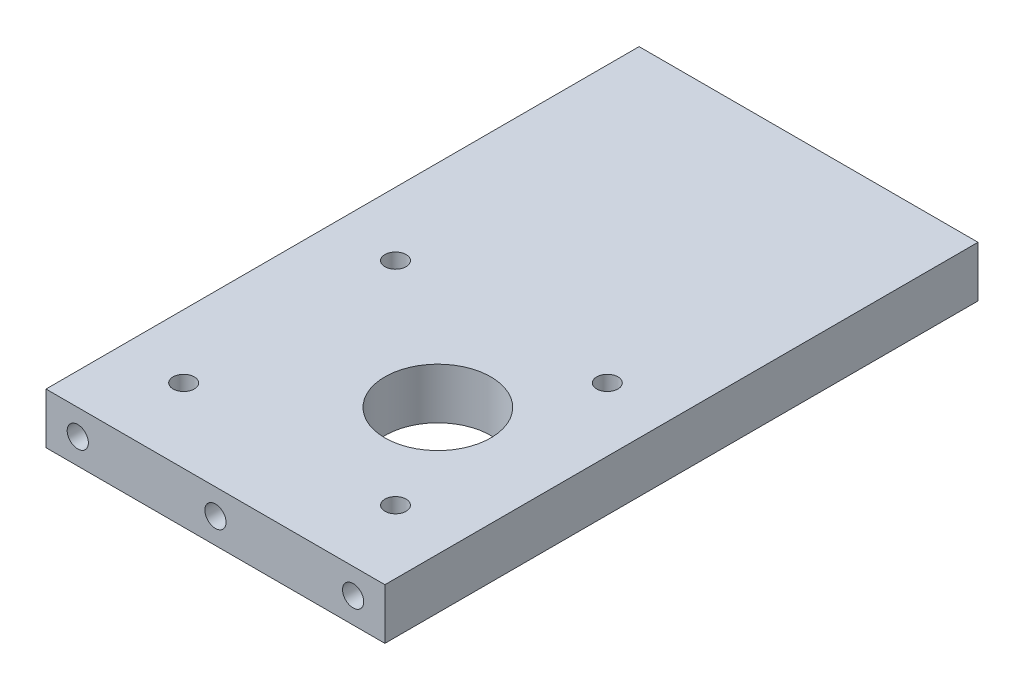
ISO-10303-21;
HEADER;
FILE_DESCRIPTION(('STEP AP214'),'2;1');
FILE_NAME('part.step','',(''),(''),'','','');
FILE_SCHEMA(('AUTOMOTIVE_DESIGN { 1 0 10303 214 1 1 1 1 }'));
ENDSEC;
DATA;
#1=APPLICATION_CONTEXT('core data for automotive mechanical design processes');
#2=APPLICATION_PROTOCOL_DEFINITION('international standard','automotive_design',2000,#1);
#3=PRODUCT_CONTEXT('',#1,'mechanical');
#4=PRODUCT('Part','Part','',(#3));
#5=PRODUCT_RELATED_PRODUCT_CATEGORY('part','',(#4));
#6=PRODUCT_DEFINITION_FORMATION('','',#4);
#7=PRODUCT_DEFINITION_CONTEXT('part definition',#1,'design');
#8=PRODUCT_DEFINITION('design','',#6,#7);
#9=PRODUCT_DEFINITION_SHAPE('','',#8);
#10=(LENGTH_UNIT() NAMED_UNIT(*) SI_UNIT(.MILLI.,.METRE.));
#11=(NAMED_UNIT(*) PLANE_ANGLE_UNIT() SI_UNIT($,.RADIAN.));
#12=(NAMED_UNIT(*) SI_UNIT($,.STERADIAN.) SOLID_ANGLE_UNIT());
#13=UNCERTAINTY_MEASURE_WITH_UNIT(LENGTH_MEASURE(1.E-05),#10,'distance_accuracy_value','');
#14=(GEOMETRIC_REPRESENTATION_CONTEXT(3) GLOBAL_UNCERTAINTY_ASSIGNED_CONTEXT((#13)) GLOBAL_UNIT_ASSIGNED_CONTEXT((#10,
#11,#12)) REPRESENTATION_CONTEXT('',''));
#15=CARTESIAN_POINT('',(0.,0.,0.));
#16=DIRECTION('',(0.,0.,1.));
#17=DIRECTION('',(1.,0.,0.));
#18=AXIS2_PLACEMENT_3D('',#15,#16,#17);
#19=CARTESIAN_POINT('',(0.,6.,0.));
#20=DIRECTION('',(0.,1.,0.));
#21=DIRECTION('',(0.,0.,1.));
#22=AXIS2_PLACEMENT_3D('',#19,#20,#21);
#23=PLANE('',#22);
#24=CARTESIAN_POINT('',(-25.,6.,-67.5));
#25=DIRECTION('',(0.,1.,0.));
#26=DIRECTION('',(0.,0.,1.));
#27=AXIS2_PLACEMENT_3D('',#24,#25,#26);
#28=CIRCLE('',#27,2.5);
#29=CARTESIAN_POINT('',(-25.,6.,-65.));
#30=VERTEX_POINT('',#29);
#31=EDGE_CURVE('E173',#30,#30,#28,.T.);
#32=ORIENTED_EDGE('',*,*,#31,.F.);
#33=EDGE_LOOP('',(#32));
#34=FACE_BOUND('',#33,.T.);
#35=CARTESIAN_POINT('',(25.,6.,-67.5));
#36=DIRECTION('',(0.,1.,0.));
#37=DIRECTION('',(0.,0.,1.));
#38=AXIS2_PLACEMENT_3D('',#35,#36,#37);
#39=CIRCLE('',#38,2.5);
#40=CARTESIAN_POINT('',(25.,6.,-65.));
#41=VERTEX_POINT('',#40);
#42=EDGE_CURVE('E179',#41,#41,#39,.T.);
#43=ORIENTED_EDGE('',*,*,#42,.F.);
#44=EDGE_LOOP('',(#43));
#45=FACE_BOUND('',#44,.T.);
#46=CARTESIAN_POINT('',(25.,6.,-17.5));
#47=DIRECTION('',(0.,1.,0.));
#48=DIRECTION('',(0.,0.,1.));
#49=AXIS2_PLACEMENT_3D('',#46,#47,#48);
#50=CIRCLE('',#49,2.5);
#51=CARTESIAN_POINT('',(25.,6.,-15.));
#52=VERTEX_POINT('',#51);
#53=EDGE_CURVE('E185',#52,#52,#50,.T.);
#54=ORIENTED_EDGE('',*,*,#53,.F.);
#55=EDGE_LOOP('',(#54));
#56=FACE_BOUND('',#55,.T.);
#57=CARTESIAN_POINT('',(-25.,6.,-17.5));
#58=DIRECTION('',(0.,1.,0.));
#59=DIRECTION('',(0.,0.,1.));
#60=AXIS2_PLACEMENT_3D('',#57,#58,#59);
#61=CIRCLE('',#60,2.5);
#62=CARTESIAN_POINT('',(-25.,6.,-15.));
#63=VERTEX_POINT('',#62);
#64=EDGE_CURVE('E191',#63,#63,#61,.T.);
#65=ORIENTED_EDGE('',*,*,#64,.F.);
#66=EDGE_LOOP('',(#65));
#67=FACE_BOUND('',#66,.T.);
#68=DIRECTION('',(0.,0.,1.));
#69=VECTOR('',#68,1.);
#70=CARTESIAN_POINT('',(-40.,6.,-140.));
#71=LINE('',#70,#69);
#72=CARTESIAN_POINT('',(-40.,6.,-140.));
#73=VERTEX_POINT('',#72);
#74=CARTESIAN_POINT('',(-40.,6.,0.));
#75=VERTEX_POINT('',#74);
#76=EDGE_CURVE('E204',#73,#75,#71,.T.);
#77=ORIENTED_EDGE('',*,*,#76,.T.);
#78=DIRECTION('',(1.,0.,0.));
#79=VECTOR('',#78,1.);
#80=CARTESIAN_POINT('',(-40.,6.,0.));
#81=LINE('',#80,#79);
#82=CARTESIAN_POINT('',(40.,6.,0.));
#83=VERTEX_POINT('',#82);
#84=EDGE_CURVE('E91',#75,#83,#81,.T.);
#85=ORIENTED_EDGE('',*,*,#84,.T.);
#86=DIRECTION('',(0.,0.,-1.));
#87=VECTOR('',#86,1.);
#88=CARTESIAN_POINT('',(40.,6.,-140.));
#89=LINE('',#88,#87);
#90=CARTESIAN_POINT('',(40.,6.,-140.));
#91=VERTEX_POINT('',#90);
#92=EDGE_CURVE('E207',#83,#91,#89,.T.);
#93=ORIENTED_EDGE('',*,*,#92,.T.);
#94=DIRECTION('',(-1.,0.,0.));
#95=VECTOR('',#94,1.);
#96=CARTESIAN_POINT('',(-40.,6.,-140.));
#97=LINE('',#96,#95);
#98=EDGE_CURVE('E60',#91,#73,#97,.T.);
#99=ORIENTED_EDGE('',*,*,#98,.T.);
#100=EDGE_LOOP('',(#77,#85,#93,#99));
#101=FACE_BOUND('',#100,.T.);
#102=CARTESIAN_POINT('',(10.,6.,-42.5));
#103=DIRECTION('',(0.,1.,0.));
#104=DIRECTION('',(0.,0.,1.));
#105=AXIS2_PLACEMENT_3D('',#102,#103,#104);
#106=CIRCLE('',#105,12.5);
#107=CARTESIAN_POINT('',(10.,6.,-30.));
#108=VERTEX_POINT('',#107);
#109=EDGE_CURVE('E198',#108,#108,#106,.T.);
#110=ORIENTED_EDGE('',*,*,#109,.F.);
#111=EDGE_LOOP('',(#110));
#112=FACE_BOUND('',#111,.T.);
#113=ADVANCED_FACE('F43',(#34,#45,#56,#67,#101,#112),#23,.T.);
#114=CARTESIAN_POINT('',(0.,-6.,0.));
#115=DIRECTION('',(0.,1.,0.));
#116=DIRECTION('',(0.,0.,1.));
#117=AXIS2_PLACEMENT_3D('',#114,#115,#116);
#118=PLANE('',#117);
#119=CARTESIAN_POINT('',(-25.,-6.,-67.5));
#120=DIRECTION('',(0.,1.,0.));
#121=DIRECTION('',(0.,0.,1.));
#122=AXIS2_PLACEMENT_3D('',#119,#120,#121);
#123=CIRCLE('',#122,2.5);
#124=CARTESIAN_POINT('',(-25.,-6.,-65.));
#125=VERTEX_POINT('',#124);
#126=EDGE_CURVE('E176',#125,#125,#123,.T.);
#127=ORIENTED_EDGE('',*,*,#126,.T.);
#128=EDGE_LOOP('',(#127));
#129=FACE_BOUND('',#128,.T.);
#130=CARTESIAN_POINT('',(25.,-6.,-67.5));
#131=DIRECTION('',(0.,1.,0.));
#132=DIRECTION('',(0.,0.,1.));
#133=AXIS2_PLACEMENT_3D('',#130,#131,#132);
#134=CIRCLE('',#133,2.5);
#135=CARTESIAN_POINT('',(25.,-6.,-65.));
#136=VERTEX_POINT('',#135);
#137=EDGE_CURVE('E182',#136,#136,#134,.T.);
#138=ORIENTED_EDGE('',*,*,#137,.T.);
#139=EDGE_LOOP('',(#138));
#140=FACE_BOUND('',#139,.T.);
#141=CARTESIAN_POINT('',(25.,-6.,-17.5));
#142=DIRECTION('',(0.,1.,0.));
#143=DIRECTION('',(0.,0.,1.));
#144=AXIS2_PLACEMENT_3D('',#141,#142,#143);
#145=CIRCLE('',#144,2.5);
#146=CARTESIAN_POINT('',(25.,-6.,-15.));
#147=VERTEX_POINT('',#146);
#148=EDGE_CURVE('E188',#147,#147,#145,.T.);
#149=ORIENTED_EDGE('',*,*,#148,.T.);
#150=EDGE_LOOP('',(#149));
#151=FACE_BOUND('',#150,.T.);
#152=CARTESIAN_POINT('',(-25.,-6.,-17.5));
#153=DIRECTION('',(0.,1.,0.));
#154=DIRECTION('',(0.,0.,1.));
#155=AXIS2_PLACEMENT_3D('',#152,#153,#154);
#156=CIRCLE('',#155,2.5);
#157=CARTESIAN_POINT('',(-25.,-6.,-15.));
#158=VERTEX_POINT('',#157);
#159=EDGE_CURVE('E194',#158,#158,#156,.T.);
#160=ORIENTED_EDGE('',*,*,#159,.T.);
#161=EDGE_LOOP('',(#160));
#162=FACE_BOUND('',#161,.T.);
#163=DIRECTION('',(0.,0.,1.));
#164=VECTOR('',#163,1.);
#165=CARTESIAN_POINT('',(-40.,-6.,-140.));
#166=LINE('',#165,#164);
#167=CARTESIAN_POINT('',(-40.,-6.,-140.));
#168=VERTEX_POINT('',#167);
#169=CARTESIAN_POINT('',(-40.,-6.,0.));
#170=VERTEX_POINT('',#169);
#171=EDGE_CURVE('E201',#168,#170,#166,.T.);
#172=ORIENTED_EDGE('',*,*,#171,.F.);
#173=DIRECTION('',(-1.,0.,0.));
#174=VECTOR('',#173,1.);
#175=CARTESIAN_POINT('',(-40.,-6.,-140.));
#176=LINE('',#175,#174);
#177=CARTESIAN_POINT('',(40.,-6.,-140.));
#178=VERTEX_POINT('',#177);
#179=EDGE_CURVE('E84',#178,#168,#176,.T.);
#180=ORIENTED_EDGE('',*,*,#179,.F.);
#181=DIRECTION('',(0.,0.,-1.));
#182=VECTOR('',#181,1.);
#183=CARTESIAN_POINT('',(40.,-6.,-140.));
#184=LINE('',#183,#182);
#185=CARTESIAN_POINT('',(40.,-6.,0.));
#186=VERTEX_POINT('',#185);
#187=EDGE_CURVE('E78',#186,#178,#184,.T.);
#188=ORIENTED_EDGE('',*,*,#187,.F.);
#189=DIRECTION('',(1.,0.,0.));
#190=VECTOR('',#189,1.);
#191=CARTESIAN_POINT('',(-40.,-6.,0.));
#192=LINE('',#191,#190);
#193=EDGE_CURVE('E213',#170,#186,#192,.T.);
#194=ORIENTED_EDGE('',*,*,#193,.F.);
#195=EDGE_LOOP('',(#172,#180,#188,#194));
#196=FACE_BOUND('',#195,.T.);
#197=CARTESIAN_POINT('',(10.,-6.,-42.5));
#198=DIRECTION('',(0.,1.,0.));
#199=DIRECTION('',(0.,0.,1.));
#200=AXIS2_PLACEMENT_3D('',#197,#198,#199);
#201=CIRCLE('',#200,12.5);
#202=CARTESIAN_POINT('',(10.,-6.,-30.));
#203=VERTEX_POINT('',#202);
#204=EDGE_CURVE('E197',#203,#203,#201,.T.);
#205=ORIENTED_EDGE('',*,*,#204,.T.);
#206=EDGE_LOOP('',(#205));
#207=FACE_BOUND('',#206,.T.);
#208=ADVANCED_FACE('F223',(#129,#140,#151,#162,#196,#207),#118,.F.);
#209=CARTESIAN_POINT('',(-40.,6.,-140.));
#210=DIRECTION('',(1.,0.,0.));
#211=DIRECTION('',(0.,0.,-1.));
#212=AXIS2_PLACEMENT_3D('',#209,#210,#211);
#213=PLANE('',#212);
#214=CARTESIAN_POINT('',(-40.,0.,-113.));
#215=DIRECTION('',(-1.,0.,0.));
#216=DIRECTION('',(0.,0.,1.));
#217=AXIS2_PLACEMENT_3D('',#214,#215,#216);
#218=CIRCLE('',#217,3.49999999999999);
#219=CARTESIAN_POINT('',(-40.,0.,-109.5));
#220=VERTEX_POINT('',#219);
#221=EDGE_CURVE('E127',#220,#220,#218,.T.);
#222=ORIENTED_EDGE('',*,*,#221,.F.);
#223=EDGE_LOOP('',(#222));
#224=FACE_BOUND('',#223,.T.);
#225=CARTESIAN_POINT('',(-40.,0.,-86.));
#226=DIRECTION('',(-1.,0.,0.));
#227=DIRECTION('',(0.,0.,1.));
#228=AXIS2_PLACEMENT_3D('',#225,#226,#227);
#229=CIRCLE('',#228,3.49999999999999);
#230=CARTESIAN_POINT('',(-40.,0.,-82.5));
#231=VERTEX_POINT('',#230);
#232=EDGE_CURVE('E126',#231,#231,#229,.T.);
#233=ORIENTED_EDGE('',*,*,#232,.F.);
#234=EDGE_LOOP('',(#233));
#235=FACE_BOUND('',#234,.T.);
#236=ORIENTED_EDGE('',*,*,#171,.T.);
#237=DIRECTION('',(0.,-1.,0.));
#238=VECTOR('',#237,1.);
#239=CARTESIAN_POINT('',(-40.,6.,0.));
#240=LINE('',#239,#238);
#241=EDGE_CURVE('E11',#75,#170,#240,.T.);
#242=ORIENTED_EDGE('',*,*,#241,.F.);
#243=ORIENTED_EDGE('',*,*,#76,.F.);
#244=DIRECTION('',(0.,-1.,0.));
#245=VECTOR('',#244,1.);
#246=CARTESIAN_POINT('',(-40.,6.,-140.));
#247=LINE('',#246,#245);
#248=EDGE_CURVE('E210',#73,#168,#247,.T.);
#249=ORIENTED_EDGE('',*,*,#248,.T.);
#250=EDGE_LOOP('',(#236,#242,#243,#249));
#251=FACE_BOUND('',#250,.T.);
#252=ADVANCED_FACE('F45',(#224,#235,#251),#213,.F.);
#253=CARTESIAN_POINT('',(-40.,6.,0.));
#254=DIRECTION('',(0.,0.,-1.));
#255=DIRECTION('',(-1.,0.,0.));
#256=AXIS2_PLACEMENT_3D('',#253,#254,#255);
#257=PLANE('',#256);
#258=CARTESIAN_POINT('',(32.5,0.,0.));
#259=DIRECTION('',(0.,0.,1.));
#260=DIRECTION('',(1.,0.,0.));
#261=AXIS2_PLACEMENT_3D('',#258,#259,#260);
#262=CIRCLE('',#261,2.49999999999999);
#263=CARTESIAN_POINT('',(35.,0.,0.));
#264=VERTEX_POINT('',#263);
#265=EDGE_CURVE('E155',#264,#264,#262,.T.);
#266=ORIENTED_EDGE('',*,*,#265,.F.);
#267=EDGE_LOOP('',(#266));
#268=FACE_BOUND('',#267,.T.);
#269=CARTESIAN_POINT('',(0.,0.,0.));
#270=DIRECTION('',(0.,0.,1.));
#271=DIRECTION('',(1.,0.,0.));
#272=AXIS2_PLACEMENT_3D('',#269,#270,#271);
#273=CIRCLE('',#272,2.49999999999999);
#274=CARTESIAN_POINT('',(2.49999999999999,0.,0.));
#275=VERTEX_POINT('',#274);
#276=EDGE_CURVE('E161',#275,#275,#273,.T.);
#277=ORIENTED_EDGE('',*,*,#276,.F.);
#278=EDGE_LOOP('',(#277));
#279=FACE_BOUND('',#278,.T.);
#280=CARTESIAN_POINT('',(-32.5,0.,0.));
#281=DIRECTION('',(0.,0.,1.));
#282=DIRECTION('',(1.,0.,0.));
#283=AXIS2_PLACEMENT_3D('',#280,#281,#282);
#284=CIRCLE('',#283,2.49999999999999);
#285=CARTESIAN_POINT('',(-30.,0.,0.));
#286=VERTEX_POINT('',#285);
#287=EDGE_CURVE('E167',#286,#286,#284,.T.);
#288=ORIENTED_EDGE('',*,*,#287,.F.);
#289=EDGE_LOOP('',(#288));
#290=FACE_BOUND('',#289,.T.);
#291=ORIENTED_EDGE('',*,*,#193,.T.);
#292=DIRECTION('',(0.,-1.,0.));
#293=VECTOR('',#292,1.);
#294=CARTESIAN_POINT('',(40.,6.,0.));
#295=LINE('',#294,#293);
#296=EDGE_CURVE('E52',#83,#186,#295,.T.);
#297=ORIENTED_EDGE('',*,*,#296,.F.);
#298=ORIENTED_EDGE('',*,*,#84,.F.);
#299=ORIENTED_EDGE('',*,*,#241,.T.);
#300=EDGE_LOOP('',(#291,#297,#298,#299));
#301=FACE_BOUND('',#300,.T.);
#302=ADVANCED_FACE('F240',(#268,#279,#290,#301),#257,.F.);
#303=CARTESIAN_POINT('',(40.,6.,-140.));
#304=DIRECTION('',(-1.,0.,0.));
#305=DIRECTION('',(0.,0.,1.));
#306=AXIS2_PLACEMENT_3D('',#303,#304,#305);
#307=PLANE('',#306);
#308=ORIENTED_EDGE('',*,*,#187,.T.);
#309=DIRECTION('',(0.,-1.,0.));
#310=VECTOR('',#309,1.);
#311=CARTESIAN_POINT('',(40.,6.,-140.));
#312=LINE('',#311,#310);
#313=EDGE_CURVE('E218',#91,#178,#312,.T.);
#314=ORIENTED_EDGE('',*,*,#313,.F.);
#315=ORIENTED_EDGE('',*,*,#92,.F.);
#316=ORIENTED_EDGE('',*,*,#296,.T.);
#317=EDGE_LOOP('',(#308,#314,#315,#316));
#318=FACE_BOUND('',#317,.T.);
#319=ADVANCED_FACE('F220',(#318),#307,.F.);
#320=CARTESIAN_POINT('',(-40.,6.,-140.));
#321=DIRECTION('',(0.,0.,1.));
#322=DIRECTION('',(1.,0.,0.));
#323=AXIS2_PLACEMENT_3D('',#320,#321,#322);
#324=PLANE('',#323);
#325=CARTESIAN_POINT('',(32.5,0.,-140.));
#326=DIRECTION('',(0.,0.,-1.));
#327=DIRECTION('',(-1.,0.,0.));
#328=AXIS2_PLACEMENT_3D('',#325,#326,#327);
#329=CIRCLE('',#328,2.49999999999999);
#330=CARTESIAN_POINT('',(30.,0.,-140.));
#331=VERTEX_POINT('',#330);
#332=EDGE_CURVE('E137',#331,#331,#329,.T.);
#333=ORIENTED_EDGE('',*,*,#332,.F.);
#334=EDGE_LOOP('',(#333));
#335=FACE_BOUND('',#334,.T.);
#336=CARTESIAN_POINT('',(0.,0.,-140.));
#337=DIRECTION('',(0.,0.,-1.));
#338=DIRECTION('',(-1.,0.,0.));
#339=AXIS2_PLACEMENT_3D('',#336,#337,#338);
#340=CIRCLE('',#339,2.49999999999999);
#341=CARTESIAN_POINT('',(-2.49999999999999,0.,-140.));
#342=VERTEX_POINT('',#341);
#343=EDGE_CURVE('E143',#342,#342,#340,.T.);
#344=ORIENTED_EDGE('',*,*,#343,.F.);
#345=EDGE_LOOP('',(#344));
#346=FACE_BOUND('',#345,.T.);
#347=CARTESIAN_POINT('',(-32.5,0.,-140.));
#348=DIRECTION('',(0.,0.,-1.));
#349=DIRECTION('',(-1.,0.,0.));
#350=AXIS2_PLACEMENT_3D('',#347,#348,#349);
#351=CIRCLE('',#350,2.49999999999999);
#352=CARTESIAN_POINT('',(-35.,0.,-140.));
#353=VERTEX_POINT('',#352);
#354=EDGE_CURVE('E149',#353,#353,#351,.T.);
#355=ORIENTED_EDGE('',*,*,#354,.F.);
#356=EDGE_LOOP('',(#355));
#357=FACE_BOUND('',#356,.T.);
#358=ORIENTED_EDGE('',*,*,#179,.T.);
#359=ORIENTED_EDGE('',*,*,#248,.F.);
#360=ORIENTED_EDGE('',*,*,#98,.F.);
#361=ORIENTED_EDGE('',*,*,#313,.T.);
#362=EDGE_LOOP('',(#358,#359,#360,#361));
#363=FACE_BOUND('',#362,.T.);
#364=ADVANCED_FACE('F228',(#335,#346,#357,#363),#324,.F.);
#365=CARTESIAN_POINT('',(10.,6.,-42.5));
#366=DIRECTION('',(0.,-1.,0.));
#367=DIRECTION('',(0.,0.,-1.));
#368=AXIS2_PLACEMENT_3D('',#365,#366,#367);
#369=CYLINDRICAL_SURFACE('',#368,12.5);
#370=ORIENTED_EDGE('',*,*,#109,.T.);
#371=EDGE_LOOP('',(#370));
#372=FACE_BOUND('',#371,.T.);
#373=ORIENTED_EDGE('',*,*,#204,.F.);
#374=EDGE_LOOP('',(#373));
#375=FACE_BOUND('',#374,.T.);
#376=ADVANCED_FACE('F230',(#372,#375),#369,.F.);
#377=CARTESIAN_POINT('',(-25.,6.,-17.5));
#378=DIRECTION('',(0.,1.,0.));
#379=DIRECTION('',(0.,0.,1.));
#380=AXIS2_PLACEMENT_3D('',#377,#378,#379);
#381=CYLINDRICAL_SURFACE('',#380,2.5);
#382=ORIENTED_EDGE('',*,*,#159,.F.);
#383=EDGE_LOOP('',(#382));
#384=FACE_BOUND('',#383,.T.);
#385=ORIENTED_EDGE('',*,*,#64,.T.);
#386=EDGE_LOOP('',(#385));
#387=FACE_BOUND('',#386,.T.);
#388=ADVANCED_FACE('F237',(#384,#387),#381,.F.);
#389=CARTESIAN_POINT('',(25.,6.,-17.5));
#390=DIRECTION('',(0.,1.,0.));
#391=DIRECTION('',(0.,0.,1.));
#392=AXIS2_PLACEMENT_3D('',#389,#390,#391);
#393=CYLINDRICAL_SURFACE('',#392,2.5);
#394=ORIENTED_EDGE('',*,*,#148,.F.);
#395=EDGE_LOOP('',(#394));
#396=FACE_BOUND('',#395,.T.);
#397=ORIENTED_EDGE('',*,*,#53,.T.);
#398=EDGE_LOOP('',(#397));
#399=FACE_BOUND('',#398,.T.);
#400=ADVANCED_FACE('F257',(#396,#399),#393,.F.);
#401=CARTESIAN_POINT('',(25.,6.,-67.5));
#402=DIRECTION('',(0.,1.,0.));
#403=DIRECTION('',(0.,0.,1.));
#404=AXIS2_PLACEMENT_3D('',#401,#402,#403);
#405=CYLINDRICAL_SURFACE('',#404,2.5);
#406=ORIENTED_EDGE('',*,*,#137,.F.);
#407=EDGE_LOOP('',(#406));
#408=FACE_BOUND('',#407,.T.);
#409=ORIENTED_EDGE('',*,*,#42,.T.);
#410=EDGE_LOOP('',(#409));
#411=FACE_BOUND('',#410,.T.);
#412=ADVANCED_FACE('F261',(#408,#411),#405,.F.);
#413=CARTESIAN_POINT('',(-25.,6.,-67.5));
#414=DIRECTION('',(0.,1.,0.));
#415=DIRECTION('',(0.,0.,1.));
#416=AXIS2_PLACEMENT_3D('',#413,#414,#415);
#417=CYLINDRICAL_SURFACE('',#416,2.5);
#418=ORIENTED_EDGE('',*,*,#126,.F.);
#419=EDGE_LOOP('',(#418));
#420=FACE_BOUND('',#419,.T.);
#421=ORIENTED_EDGE('',*,*,#31,.T.);
#422=EDGE_LOOP('',(#421));
#423=FACE_BOUND('',#422,.T.);
#424=ADVANCED_FACE('F265',(#420,#423),#417,.F.);
#425=CARTESIAN_POINT('',(-32.5,0.,-13.));
#426=DIRECTION('',(0.,0.,1.));
#427=DIRECTION('',(1.,0.,0.));
#428=AXIS2_PLACEMENT_3D('',#425,#426,#427);
#429=CONICAL_SURFACE('',#428,2.5,1.02974425867665);
#430=CARTESIAN_POINT('',(-32.5,0.,-14.5021515475689));
#431=VERTEX_POINT('',#430);
#432=VERTEX_LOOP('',#431);
#433=FACE_BOUND('',#432,.T.);
#434=CARTESIAN_POINT('',(-32.5,0.,-13.));
#435=DIRECTION('',(0.,0.,1.));
#436=DIRECTION('',(1.,0.,0.));
#437=AXIS2_PLACEMENT_3D('',#434,#435,#436);
#438=CIRCLE('',#437,2.5);
#439=CARTESIAN_POINT('',(-30.,0.,-13.));
#440=VERTEX_POINT('',#439);
#441=EDGE_CURVE('E170',#440,#440,#438,.T.);
#442=ORIENTED_EDGE('',*,*,#441,.T.);
#443=EDGE_LOOP('',(#442));
#444=FACE_BOUND('',#443,.T.);
#445=ADVANCED_FACE('F269',(#433,#444),#429,.F.);
#446=CARTESIAN_POINT('',(-32.5,0.,0.));
#447=DIRECTION('',(0.,0.,1.));
#448=DIRECTION('',(1.,0.,0.));
#449=AXIS2_PLACEMENT_3D('',#446,#447,#448);
#450=CYLINDRICAL_SURFACE('',#449,2.49999999999999);
#451=ORIENTED_EDGE('',*,*,#441,.F.);
#452=EDGE_LOOP('',(#451));
#453=FACE_BOUND('',#452,.T.);
#454=ORIENTED_EDGE('',*,*,#287,.T.);
#455=EDGE_LOOP('',(#454));
#456=FACE_BOUND('',#455,.T.);
#457=ADVANCED_FACE('F273',(#453,#456),#450,.F.);
#458=CARTESIAN_POINT('',(0.,0.,-13.));
#459=DIRECTION('',(0.,0.,1.));
#460=DIRECTION('',(1.,0.,0.));
#461=AXIS2_PLACEMENT_3D('',#458,#459,#460);
#462=CONICAL_SURFACE('',#461,2.5,1.02974425867665);
#463=CARTESIAN_POINT('',(0.,0.,-14.5021515475689));
#464=VERTEX_POINT('',#463);
#465=VERTEX_LOOP('',#464);
#466=FACE_BOUND('',#465,.T.);
#467=CARTESIAN_POINT('',(0.,0.,-13.));
#468=DIRECTION('',(0.,0.,1.));
#469=DIRECTION('',(1.,0.,0.));
#470=AXIS2_PLACEMENT_3D('',#467,#468,#469);
#471=CIRCLE('',#470,2.5);
#472=CARTESIAN_POINT('',(2.5,0.,-13.));
#473=VERTEX_POINT('',#472);
#474=EDGE_CURVE('E164',#473,#473,#471,.T.);
#475=ORIENTED_EDGE('',*,*,#474,.T.);
#476=EDGE_LOOP('',(#475));
#477=FACE_BOUND('',#476,.T.);
#478=ADVANCED_FACE('F277',(#466,#477),#462,.F.);
#479=CARTESIAN_POINT('',(0.,0.,0.));
#480=DIRECTION('',(0.,0.,1.));
#481=DIRECTION('',(1.,0.,0.));
#482=AXIS2_PLACEMENT_3D('',#479,#480,#481);
#483=CYLINDRICAL_SURFACE('',#482,2.49999999999999);
#484=ORIENTED_EDGE('',*,*,#474,.F.);
#485=EDGE_LOOP('',(#484));
#486=FACE_BOUND('',#485,.T.);
#487=ORIENTED_EDGE('',*,*,#276,.T.);
#488=EDGE_LOOP('',(#487));
#489=FACE_BOUND('',#488,.T.);
#490=ADVANCED_FACE('F281',(#486,#489),#483,.F.);
#491=CARTESIAN_POINT('',(32.5,0.,-13.));
#492=DIRECTION('',(0.,0.,1.));
#493=DIRECTION('',(1.,0.,0.));
#494=AXIS2_PLACEMENT_3D('',#491,#492,#493);
#495=CONICAL_SURFACE('',#494,2.5,1.02974425867665);
#496=CARTESIAN_POINT('',(32.5,0.,-14.5021515475689));
#497=VERTEX_POINT('',#496);
#498=VERTEX_LOOP('',#497);
#499=FACE_BOUND('',#498,.T.);
#500=CARTESIAN_POINT('',(32.5,0.,-13.));
#501=DIRECTION('',(0.,0.,1.));
#502=DIRECTION('',(1.,0.,0.));
#503=AXIS2_PLACEMENT_3D('',#500,#501,#502);
#504=CIRCLE('',#503,2.5);
#505=CARTESIAN_POINT('',(35.,0.,-13.));
#506=VERTEX_POINT('',#505);
#507=EDGE_CURVE('E158',#506,#506,#504,.T.);
#508=ORIENTED_EDGE('',*,*,#507,.T.);
#509=EDGE_LOOP('',(#508));
#510=FACE_BOUND('',#509,.T.);
#511=ADVANCED_FACE('F285',(#499,#510),#495,.F.);
#512=CARTESIAN_POINT('',(32.5,0.,0.));
#513=DIRECTION('',(0.,0.,1.));
#514=DIRECTION('',(1.,0.,0.));
#515=AXIS2_PLACEMENT_3D('',#512,#513,#514);
#516=CYLINDRICAL_SURFACE('',#515,2.49999999999999);
#517=ORIENTED_EDGE('',*,*,#507,.F.);
#518=EDGE_LOOP('',(#517));
#519=FACE_BOUND('',#518,.T.);
#520=ORIENTED_EDGE('',*,*,#265,.T.);
#521=EDGE_LOOP('',(#520));
#522=FACE_BOUND('',#521,.T.);
#523=ADVANCED_FACE('F289',(#519,#522),#516,.F.);
#524=CARTESIAN_POINT('',(-32.5,0.,-127.));
#525=DIRECTION('',(0.,0.,-1.));
#526=DIRECTION('',(-1.,0.,0.));
#527=AXIS2_PLACEMENT_3D('',#524,#525,#526);
#528=CONICAL_SURFACE('',#527,2.5,1.02974425867666);
#529=CARTESIAN_POINT('',(-32.5,0.,-125.497848452431));
#530=VERTEX_POINT('',#529);
#531=VERTEX_LOOP('',#530);
#532=FACE_BOUND('',#531,.T.);
#533=CARTESIAN_POINT('',(-32.5,0.,-127.));
#534=DIRECTION('',(0.,0.,-1.));
#535=DIRECTION('',(-1.,0.,0.));
#536=AXIS2_PLACEMENT_3D('',#533,#534,#535);
#537=CIRCLE('',#536,2.5);
#538=CARTESIAN_POINT('',(-35.,0.,-127.));
#539=VERTEX_POINT('',#538);
#540=EDGE_CURVE('E152',#539,#539,#537,.T.);
#541=ORIENTED_EDGE('',*,*,#540,.T.);
#542=EDGE_LOOP('',(#541));
#543=FACE_BOUND('',#542,.T.);
#544=ADVANCED_FACE('F293',(#532,#543),#528,.F.);
#545=CARTESIAN_POINT('',(-32.5,0.,-140.));
#546=DIRECTION('',(0.,0.,-1.));
#547=DIRECTION('',(-1.,0.,0.));
#548=AXIS2_PLACEMENT_3D('',#545,#546,#547);
#549=CYLINDRICAL_SURFACE('',#548,2.49999999999999);
#550=ORIENTED_EDGE('',*,*,#540,.F.);
#551=EDGE_LOOP('',(#550));
#552=FACE_BOUND('',#551,.T.);
#553=ORIENTED_EDGE('',*,*,#354,.T.);
#554=EDGE_LOOP('',(#553));
#555=FACE_BOUND('',#554,.T.);
#556=ADVANCED_FACE('F297',(#552,#555),#549,.F.);
#557=CARTESIAN_POINT('',(0.,0.,-127.));
#558=DIRECTION('',(0.,0.,-1.));
#559=DIRECTION('',(-1.,0.,0.));
#560=AXIS2_PLACEMENT_3D('',#557,#558,#559);
#561=CONICAL_SURFACE('',#560,2.5,1.02974425867666);
#562=CARTESIAN_POINT('',(0.,0.,-125.497848452431));
#563=VERTEX_POINT('',#562);
#564=VERTEX_LOOP('',#563);
#565=FACE_BOUND('',#564,.T.);
#566=CARTESIAN_POINT('',(0.,0.,-127.));
#567=DIRECTION('',(0.,0.,-1.));
#568=DIRECTION('',(-1.,0.,0.));
#569=AXIS2_PLACEMENT_3D('',#566,#567,#568);
#570=CIRCLE('',#569,2.5);
#571=CARTESIAN_POINT('',(-2.5,0.,-127.));
#572=VERTEX_POINT('',#571);
#573=EDGE_CURVE('E146',#572,#572,#570,.T.);
#574=ORIENTED_EDGE('',*,*,#573,.T.);
#575=EDGE_LOOP('',(#574));
#576=FACE_BOUND('',#575,.T.);
#577=ADVANCED_FACE('F301',(#565,#576),#561,.F.);
#578=CARTESIAN_POINT('',(0.,0.,-140.));
#579=DIRECTION('',(0.,0.,-1.));
#580=DIRECTION('',(-1.,0.,0.));
#581=AXIS2_PLACEMENT_3D('',#578,#579,#580);
#582=CYLINDRICAL_SURFACE('',#581,2.49999999999999);
#583=ORIENTED_EDGE('',*,*,#573,.F.);
#584=EDGE_LOOP('',(#583));
#585=FACE_BOUND('',#584,.T.);
#586=ORIENTED_EDGE('',*,*,#343,.T.);
#587=EDGE_LOOP('',(#586));
#588=FACE_BOUND('',#587,.T.);
#589=ADVANCED_FACE('F305',(#585,#588),#582,.F.);
#590=CARTESIAN_POINT('',(32.5,0.,-127.));
#591=DIRECTION('',(0.,0.,-1.));
#592=DIRECTION('',(-1.,0.,0.));
#593=AXIS2_PLACEMENT_3D('',#590,#591,#592);
#594=CONICAL_SURFACE('',#593,2.5,1.02974425867666);
#595=CARTESIAN_POINT('',(32.5,0.,-125.497848452431));
#596=VERTEX_POINT('',#595);
#597=VERTEX_LOOP('',#596);
#598=FACE_BOUND('',#597,.T.);
#599=CARTESIAN_POINT('',(32.5,0.,-127.));
#600=DIRECTION('',(0.,0.,-1.));
#601=DIRECTION('',(-1.,0.,0.));
#602=AXIS2_PLACEMENT_3D('',#599,#600,#601);
#603=CIRCLE('',#602,2.5);
#604=CARTESIAN_POINT('',(30.,0.,-127.));
#605=VERTEX_POINT('',#604);
#606=EDGE_CURVE('E140',#605,#605,#603,.T.);
#607=ORIENTED_EDGE('',*,*,#606,.T.);
#608=EDGE_LOOP('',(#607));
#609=FACE_BOUND('',#608,.T.);
#610=ADVANCED_FACE('F309',(#598,#609),#594,.F.);
#611=CARTESIAN_POINT('',(32.5,0.,-140.));
#612=DIRECTION('',(0.,0.,-1.));
#613=DIRECTION('',(-1.,0.,0.));
#614=AXIS2_PLACEMENT_3D('',#611,#612,#613);
#615=CYLINDRICAL_SURFACE('',#614,2.49999999999999);
#616=ORIENTED_EDGE('',*,*,#606,.F.);
#617=EDGE_LOOP('',(#616));
#618=FACE_BOUND('',#617,.T.);
#619=ORIENTED_EDGE('',*,*,#332,.T.);
#620=EDGE_LOOP('',(#619));
#621=FACE_BOUND('',#620,.T.);
#622=ADVANCED_FACE('F313',(#618,#621),#615,.F.);
#623=CARTESIAN_POINT('',(-21.,0.,-86.));
#624=DIRECTION('',(-1.,0.,0.));
#625=DIRECTION('',(0.,0.,1.));
#626=AXIS2_PLACEMENT_3D('',#623,#624,#625);
#627=CONICAL_SURFACE('',#626,3.49999999999999,1.02974425867665);
#628=CARTESIAN_POINT('',(-18.8969878334035,0.,-86.));
#629=VERTEX_POINT('',#628);
#630=VERTEX_LOOP('',#629);
#631=FACE_BOUND('',#630,.T.);
#632=CARTESIAN_POINT('',(-21.,0.,-86.));
#633=DIRECTION('',(-1.,0.,0.));
#634=DIRECTION('',(0.,0.,1.));
#635=AXIS2_PLACEMENT_3D('',#632,#633,#634);
#636=CIRCLE('',#635,3.49999999999999);
#637=CARTESIAN_POINT('',(-21.,0.,-82.5));
#638=VERTEX_POINT('',#637);
#639=EDGE_CURVE('E130',#638,#638,#636,.T.);
#640=ORIENTED_EDGE('',*,*,#639,.T.);
#641=EDGE_LOOP('',(#640));
#642=FACE_BOUND('',#641,.T.);
#643=ADVANCED_FACE('F317',(#631,#642),#627,.F.);
#644=CARTESIAN_POINT('',(-40.,0.,-86.));
#645=DIRECTION('',(-1.,0.,0.));
#646=DIRECTION('',(0.,0.,1.));
#647=AXIS2_PLACEMENT_3D('',#644,#645,#646);
#648=CYLINDRICAL_SURFACE('',#647,3.49999999999999);
#649=ORIENTED_EDGE('',*,*,#639,.F.);
#650=EDGE_LOOP('',(#649));
#651=FACE_BOUND('',#650,.T.);
#652=ORIENTED_EDGE('',*,*,#232,.T.);
#653=EDGE_LOOP('',(#652));
#654=FACE_BOUND('',#653,.T.);
#655=ADVANCED_FACE('F120',(#651,#654),#648,.F.);
#656=CARTESIAN_POINT('',(-21.,0.,-113.));
#657=DIRECTION('',(-1.,0.,0.));
#658=DIRECTION('',(0.,0.,1.));
#659=AXIS2_PLACEMENT_3D('',#656,#657,#658);
#660=CONICAL_SURFACE('',#659,3.49999999999999,1.02974425867665);
#661=CARTESIAN_POINT('',(-18.8969878334035,0.,-113.));
#662=VERTEX_POINT('',#661);
#663=VERTEX_LOOP('',#662);
#664=FACE_BOUND('',#663,.T.);
#665=CARTESIAN_POINT('',(-21.,0.,-113.));
#666=DIRECTION('',(-1.,0.,0.));
#667=DIRECTION('',(0.,0.,1.));
#668=AXIS2_PLACEMENT_3D('',#665,#666,#667);
#669=CIRCLE('',#668,3.49999999999999);
#670=CARTESIAN_POINT('',(-21.,0.,-109.5));
#671=VERTEX_POINT('',#670);
#672=EDGE_CURVE('E124',#671,#671,#669,.T.);
#673=ORIENTED_EDGE('',*,*,#672,.T.);
#674=EDGE_LOOP('',(#673));
#675=FACE_BOUND('',#674,.T.);
#676=ADVANCED_FACE('F116',(#664,#675),#660,.F.);
#677=CARTESIAN_POINT('',(-40.,0.,-113.));
#678=DIRECTION('',(-1.,0.,0.));
#679=DIRECTION('',(0.,0.,1.));
#680=AXIS2_PLACEMENT_3D('',#677,#678,#679);
#681=CYLINDRICAL_SURFACE('',#680,3.49999999999999);
#682=ORIENTED_EDGE('',*,*,#672,.F.);
#683=EDGE_LOOP('',(#682));
#684=FACE_BOUND('',#683,.T.);
#685=ORIENTED_EDGE('',*,*,#221,.T.);
#686=EDGE_LOOP('',(#685));
#687=FACE_BOUND('',#686,.T.);
#688=ADVANCED_FACE('F119',(#684,#687),#681,.F.);
#689=CLOSED_SHELL('',(#113,#208,#252,#302,#319,#364,#376,#388,#400,#412,#424,#445,#457,#478,
#490,#511,#523,#544,#556,#577,#589,#610,#622,#643,#655,#676,#688));
#690=MANIFOLD_SOLID_BREP('B2',#689);
#691=ADVANCED_BREP_SHAPE_REPRESENTATION('',(#18,#690),#14);
#692=SHAPE_DEFINITION_REPRESENTATION(#9,#691);
ENDSEC;
END-ISO-10303-21;
